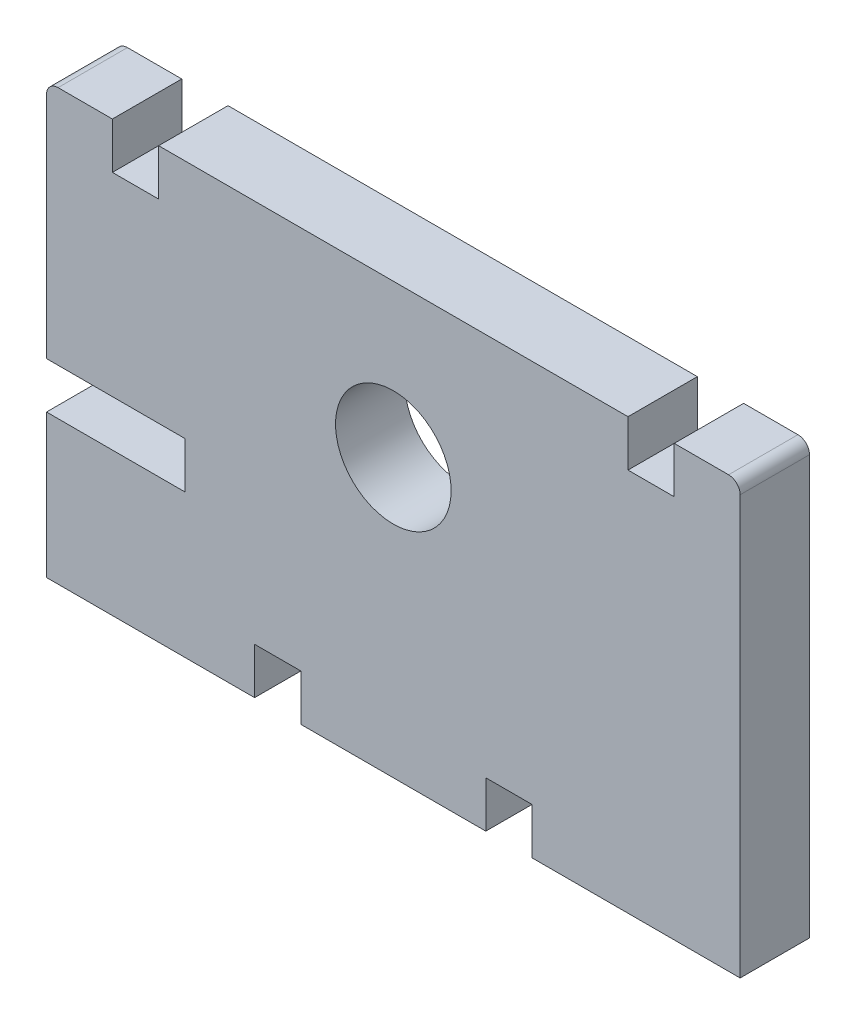
ISO-10303-21;
HEADER;
FILE_DESCRIPTION(('STEP AP214'),'2;1');
FILE_NAME('part.step','',(''),(''),'','','');
FILE_SCHEMA(('AUTOMOTIVE_DESIGN { 1 0 10303 214 1 1 1 1 }'));
ENDSEC;
DATA;
#1=APPLICATION_CONTEXT('core data for automotive mechanical design processes');
#2=APPLICATION_PROTOCOL_DEFINITION('international standard','automotive_design',2000,#1);
#3=PRODUCT_CONTEXT('',#1,'mechanical');
#4=PRODUCT('Part','Part','',(#3));
#5=PRODUCT_RELATED_PRODUCT_CATEGORY('part','',(#4));
#6=PRODUCT_DEFINITION_FORMATION('','',#4);
#7=PRODUCT_DEFINITION_CONTEXT('part definition',#1,'design');
#8=PRODUCT_DEFINITION('design','',#6,#7);
#9=PRODUCT_DEFINITION_SHAPE('','',#8);
#10=(LENGTH_UNIT() NAMED_UNIT(*) SI_UNIT(.MILLI.,.METRE.));
#11=(NAMED_UNIT(*) PLANE_ANGLE_UNIT() SI_UNIT($,.RADIAN.));
#12=(NAMED_UNIT(*) SI_UNIT($,.STERADIAN.) SOLID_ANGLE_UNIT());
#13=UNCERTAINTY_MEASURE_WITH_UNIT(LENGTH_MEASURE(1.E-05),#10,'distance_accuracy_value','');
#14=(GEOMETRIC_REPRESENTATION_CONTEXT(3) GLOBAL_UNCERTAINTY_ASSIGNED_CONTEXT((#13)) GLOBAL_UNIT_ASSIGNED_CONTEXT((#10,
#11,#12)) REPRESENTATION_CONTEXT('',''));
#15=CARTESIAN_POINT('',(0.,0.,0.));
#16=DIRECTION('',(0.,0.,1.));
#17=DIRECTION('',(1.,0.,0.));
#18=AXIS2_PLACEMENT_3D('',#15,#16,#17);
#19=CARTESIAN_POINT('',(3.99999999999999,0.,3.));
#20=DIRECTION('',(1.,0.,0.));
#21=DIRECTION('',(0.,1.,0.));
#22=AXIS2_PLACEMENT_3D('',#19,#20,#21);
#23=PLANE('',#22);
#24=DIRECTION('',(0.,-1.,0.));
#25=VECTOR('',#24,1.);
#26=CARTESIAN_POINT('',(3.99999999999999,0.,0.));
#27=LINE('',#26,#25);
#28=CARTESIAN_POINT('',(4.,-10.,0.));
#29=VERTEX_POINT('',#28);
#30=CARTESIAN_POINT('',(4.,-12.,0.));
#31=VERTEX_POINT('',#30);
#32=EDGE_CURVE('E219',#29,#31,#27,.T.);
#33=ORIENTED_EDGE('',*,*,#32,.F.);
#34=DIRECTION('',(0.,0.,-1.));
#35=VECTOR('',#34,1.);
#36=CARTESIAN_POINT('',(4.,-10.,3.));
#37=LINE('',#36,#35);
#38=CARTESIAN_POINT('',(4.,-10.,3.));
#39=VERTEX_POINT('',#38);
#40=EDGE_CURVE('E215',#39,#29,#37,.T.);
#41=ORIENTED_EDGE('',*,*,#40,.F.);
#42=DIRECTION('',(0.,-1.,0.));
#43=VECTOR('',#42,1.);
#44=CARTESIAN_POINT('',(3.99999999999999,0.,3.));
#45=LINE('',#44,#43);
#46=CARTESIAN_POINT('',(4.,-12.,3.));
#47=VERTEX_POINT('',#46);
#48=EDGE_CURVE('E217',#39,#47,#45,.T.);
#49=ORIENTED_EDGE('',*,*,#48,.T.);
#50=DIRECTION('',(0.,0.,-1.));
#51=VECTOR('',#50,1.);
#52=CARTESIAN_POINT('',(4.,-12.,3.));
#53=LINE('',#52,#51);
#54=EDGE_CURVE('E397',#47,#31,#53,.T.);
#55=ORIENTED_EDGE('',*,*,#54,.T.);
#56=EDGE_LOOP('',(#33,#41,#49,#55));
#57=FACE_BOUND('',#56,.T.);
#58=ADVANCED_FACE('F41',(#57),#23,.T.);
#59=CARTESIAN_POINT('',(0.,-10.,3.));
#60=DIRECTION('',(0.,-1.,0.));
#61=DIRECTION('',(0.,0.,-1.));
#62=AXIS2_PLACEMENT_3D('',#59,#60,#61);
#63=PLANE('',#62);
#64=DIRECTION('',(-1.,0.,0.));
#65=VECTOR('',#64,1.);
#66=CARTESIAN_POINT('',(0.,-10.,0.));
#67=LINE('',#66,#65);
#68=CARTESIAN_POINT('',(6.,-10.,0.));
#69=VERTEX_POINT('',#68);
#70=EDGE_CURVE('E320',#69,#29,#67,.T.);
#71=ORIENTED_EDGE('',*,*,#70,.F.);
#72=DIRECTION('',(0.,0.,-1.));
#73=VECTOR('',#72,1.);
#74=CARTESIAN_POINT('',(6.,-10.,3.));
#75=LINE('',#74,#73);
#76=CARTESIAN_POINT('',(6.,-10.,3.));
#77=VERTEX_POINT('',#76);
#78=EDGE_CURVE('E226',#77,#69,#75,.T.);
#79=ORIENTED_EDGE('',*,*,#78,.F.);
#80=DIRECTION('',(-1.,0.,0.));
#81=VECTOR('',#80,1.);
#82=CARTESIAN_POINT('',(0.,-10.,3.));
#83=LINE('',#82,#81);
#84=EDGE_CURVE('E232',#77,#39,#83,.T.);
#85=ORIENTED_EDGE('',*,*,#84,.T.);
#86=ORIENTED_EDGE('',*,*,#40,.T.);
#87=EDGE_LOOP('',(#71,#79,#85,#86));
#88=FACE_BOUND('',#87,.T.);
#89=ADVANCED_FACE('F240',(#88),#63,.T.);
#90=CARTESIAN_POINT('',(6.,0.,3.));
#91=DIRECTION('',(-1.,0.,0.));
#92=DIRECTION('',(0.,0.,1.));
#93=AXIS2_PLACEMENT_3D('',#90,#91,#92);
#94=PLANE('',#93);
#95=DIRECTION('',(0.,1.,0.));
#96=VECTOR('',#95,1.);
#97=CARTESIAN_POINT('',(6.,0.,0.));
#98=LINE('',#97,#96);
#99=CARTESIAN_POINT('',(6.,-12.,0.));
#100=VERTEX_POINT('',#99);
#101=EDGE_CURVE('E323',#100,#69,#98,.T.);
#102=ORIENTED_EDGE('',*,*,#101,.F.);
#103=DIRECTION('',(0.,0.,-1.));
#104=VECTOR('',#103,1.);
#105=CARTESIAN_POINT('',(6.,-12.,3.));
#106=LINE('',#105,#104);
#107=CARTESIAN_POINT('',(6.,-12.,3.));
#108=VERTEX_POINT('',#107);
#109=EDGE_CURVE('E464',#108,#100,#106,.T.);
#110=ORIENTED_EDGE('',*,*,#109,.F.);
#111=DIRECTION('',(0.,1.,0.));
#112=VECTOR('',#111,1.);
#113=CARTESIAN_POINT('',(6.,0.,3.));
#114=LINE('',#113,#112);
#115=EDGE_CURVE('E242',#108,#77,#114,.T.);
#116=ORIENTED_EDGE('',*,*,#115,.T.);
#117=ORIENTED_EDGE('',*,*,#78,.T.);
#118=EDGE_LOOP('',(#102,#110,#116,#117));
#119=FACE_BOUND('',#118,.T.);
#120=ADVANCED_FACE('F548',(#119),#94,.T.);
#121=CARTESIAN_POINT('',(0.,-12.,3.));
#122=DIRECTION('',(0.,1.,0.));
#123=DIRECTION('',(0.,0.,1.));
#124=AXIS2_PLACEMENT_3D('',#121,#122,#123);
#125=PLANE('',#124);
#126=DIRECTION('',(1.,0.,0.));
#127=VECTOR('',#126,1.);
#128=CARTESIAN_POINT('',(0.,-12.,0.));
#129=LINE('',#128,#127);
#130=CARTESIAN_POINT('',(15.,-12.,0.));
#131=VERTEX_POINT('',#130);
#132=EDGE_CURVE('E327',#100,#131,#129,.T.);
#133=ORIENTED_EDGE('',*,*,#132,.T.);
#134=DIRECTION('',(0.,0.,-1.));
#135=VECTOR('',#134,1.);
#136=CARTESIAN_POINT('',(15.,-12.,3.));
#137=LINE('',#136,#135);
#138=CARTESIAN_POINT('',(15.,-12.,3.));
#139=VERTEX_POINT('',#138);
#140=EDGE_CURVE('E460',#139,#131,#137,.T.);
#141=ORIENTED_EDGE('',*,*,#140,.F.);
#142=DIRECTION('',(1.,0.,0.));
#143=VECTOR('',#142,1.);
#144=CARTESIAN_POINT('',(0.,-12.,3.));
#145=LINE('',#144,#143);
#146=EDGE_CURVE('E245',#108,#139,#145,.T.);
#147=ORIENTED_EDGE('',*,*,#146,.F.);
#148=ORIENTED_EDGE('',*,*,#109,.T.);
#149=EDGE_LOOP('',(#133,#141,#147,#148));
#150=FACE_BOUND('',#149,.T.);
#151=ADVANCED_FACE('F612',(#150),#125,.F.);
#152=CARTESIAN_POINT('',(15.,0.,3.));
#153=DIRECTION('',(1.,0.,0.));
#154=DIRECTION('',(0.,1.,0.));
#155=AXIS2_PLACEMENT_3D('',#152,#153,#154);
#156=PLANE('',#155);
#157=DIRECTION('',(0.,-1.,0.));
#158=VECTOR('',#157,1.);
#159=CARTESIAN_POINT('',(15.,0.,0.));
#160=LINE('',#159,#158);
#161=CARTESIAN_POINT('',(15.,6.1,0.));
#162=VERTEX_POINT('',#161);
#163=EDGE_CURVE('E331',#162,#131,#160,.T.);
#164=ORIENTED_EDGE('',*,*,#163,.F.);
#165=DIRECTION('',(0.,0.,-1.));
#166=VECTOR('',#165,1.);
#167=CARTESIAN_POINT('',(15.,6.1,3.));
#168=LINE('',#167,#166);
#169=CARTESIAN_POINT('',(15.,6.1,3.));
#170=VERTEX_POINT('',#169);
#171=EDGE_CURVE('E11',#162,#170,#168,.F.);
#172=ORIENTED_EDGE('',*,*,#171,.T.);
#173=DIRECTION('',(0.,-1.,0.));
#174=VECTOR('',#173,1.);
#175=CARTESIAN_POINT('',(15.,0.,3.));
#176=LINE('',#175,#174);
#177=EDGE_CURVE('E252',#170,#139,#176,.T.);
#178=ORIENTED_EDGE('',*,*,#177,.T.);
#179=ORIENTED_EDGE('',*,*,#140,.T.);
#180=EDGE_LOOP('',(#164,#172,#178,#179));
#181=FACE_BOUND('',#180,.T.);
#182=ADVANCED_FACE('F613',(#181),#156,.T.);
#183=CARTESIAN_POINT('',(0.,6.6,3.));
#184=DIRECTION('',(0.,1.,0.));
#185=DIRECTION('',(0.,0.,1.));
#186=AXIS2_PLACEMENT_3D('',#183,#184,#185);
#187=PLANE('',#186);
#188=DIRECTION('',(1.,0.,0.));
#189=VECTOR('',#188,1.);
#190=CARTESIAN_POINT('',(0.,6.6,3.));
#191=LINE('',#190,#189);
#192=CARTESIAN_POINT('',(12.15,6.6,3.));
#193=VERTEX_POINT('',#192);
#194=CARTESIAN_POINT('',(14.5,6.6,3.));
#195=VERTEX_POINT('',#194);
#196=EDGE_CURVE('E256',#193,#195,#191,.T.);
#197=ORIENTED_EDGE('',*,*,#196,.T.);
#198=DIRECTION('',(0.,0.,-1.));
#199=VECTOR('',#198,1.);
#200=CARTESIAN_POINT('',(14.5,6.6,3.));
#201=LINE('',#200,#199);
#202=CARTESIAN_POINT('',(14.5,6.6,0.));
#203=VERTEX_POINT('',#202);
#204=EDGE_CURVE('E50',#195,#203,#201,.T.);
#205=ORIENTED_EDGE('',*,*,#204,.T.);
#206=DIRECTION('',(1.,0.,0.));
#207=VECTOR('',#206,1.);
#208=CARTESIAN_POINT('',(0.,6.6,0.));
#209=LINE('',#208,#207);
#210=CARTESIAN_POINT('',(12.15,6.6,0.));
#211=VERTEX_POINT('',#210);
#212=EDGE_CURVE('E336',#211,#203,#209,.T.);
#213=ORIENTED_EDGE('',*,*,#212,.F.);
#214=DIRECTION('',(0.,0.,-1.));
#215=VECTOR('',#214,1.);
#216=CARTESIAN_POINT('',(12.15,6.6,3.));
#217=LINE('',#216,#215);
#218=EDGE_CURVE('E457',#193,#211,#217,.T.);
#219=ORIENTED_EDGE('',*,*,#218,.F.);
#220=EDGE_LOOP('',(#197,#205,#213,#219));
#221=FACE_BOUND('',#220,.T.);
#222=ADVANCED_FACE('F490',(#221),#187,.T.);
#223=CARTESIAN_POINT('',(12.15,0.,3.));
#224=DIRECTION('',(1.,0.,0.));
#225=DIRECTION('',(0.,0.,-1.));
#226=AXIS2_PLACEMENT_3D('',#223,#224,#225);
#227=PLANE('',#226);
#228=DIRECTION('',(0.,-1.,0.));
#229=VECTOR('',#228,1.);
#230=CARTESIAN_POINT('',(12.15,0.,0.));
#231=LINE('',#230,#229);
#232=CARTESIAN_POINT('',(12.15,4.6,0.));
#233=VERTEX_POINT('',#232);
#234=EDGE_CURVE('E340',#211,#233,#231,.T.);
#235=ORIENTED_EDGE('',*,*,#234,.T.);
#236=DIRECTION('',(0.,0.,-1.));
#237=VECTOR('',#236,1.);
#238=CARTESIAN_POINT('',(12.15,4.6,3.));
#239=LINE('',#238,#237);
#240=CARTESIAN_POINT('',(12.15,4.6,3.));
#241=VERTEX_POINT('',#240);
#242=EDGE_CURVE('E453',#241,#233,#239,.T.);
#243=ORIENTED_EDGE('',*,*,#242,.F.);
#244=DIRECTION('',(0.,-1.,0.));
#245=VECTOR('',#244,1.);
#246=CARTESIAN_POINT('',(12.15,0.,3.));
#247=LINE('',#246,#245);
#248=EDGE_CURVE('E259',#193,#241,#247,.T.);
#249=ORIENTED_EDGE('',*,*,#248,.F.);
#250=ORIENTED_EDGE('',*,*,#218,.T.);
#251=EDGE_LOOP('',(#235,#243,#249,#250));
#252=FACE_BOUND('',#251,.T.);
#253=ADVANCED_FACE('F498',(#252),#227,.F.);
#254=CARTESIAN_POINT('',(0.,4.6,3.));
#255=DIRECTION('',(0.,-1.,0.));
#256=DIRECTION('',(1.,0.,0.));
#257=AXIS2_PLACEMENT_3D('',#254,#255,#256);
#258=PLANE('',#257);
#259=DIRECTION('',(-1.,0.,0.));
#260=VECTOR('',#259,1.);
#261=CARTESIAN_POINT('',(0.,4.6,0.));
#262=LINE('',#261,#260);
#263=CARTESIAN_POINT('',(10.15,4.6,0.));
#264=VERTEX_POINT('',#263);
#265=EDGE_CURVE('E346',#233,#264,#262,.T.);
#266=ORIENTED_EDGE('',*,*,#265,.T.);
#267=DIRECTION('',(0.,0.,-1.));
#268=VECTOR('',#267,1.);
#269=CARTESIAN_POINT('',(10.15,4.6,3.));
#270=LINE('',#269,#268);
#271=CARTESIAN_POINT('',(10.15,4.6,3.));
#272=VERTEX_POINT('',#271);
#273=EDGE_CURVE('E449',#272,#264,#270,.T.);
#274=ORIENTED_EDGE('',*,*,#273,.F.);
#275=DIRECTION('',(-1.,0.,0.));
#276=VECTOR('',#275,1.);
#277=CARTESIAN_POINT('',(0.,4.6,3.));
#278=LINE('',#277,#276);
#279=EDGE_CURVE('E265',#241,#272,#278,.T.);
#280=ORIENTED_EDGE('',*,*,#279,.F.);
#281=ORIENTED_EDGE('',*,*,#242,.T.);
#282=EDGE_LOOP('',(#266,#274,#280,#281));
#283=FACE_BOUND('',#282,.T.);
#284=ADVANCED_FACE('F504',(#283),#258,.F.);
#285=CARTESIAN_POINT('',(10.15,0.,3.));
#286=DIRECTION('',(-1.,0.,0.));
#287=DIRECTION('',(0.,-1.,0.));
#288=AXIS2_PLACEMENT_3D('',#285,#286,#287);
#289=PLANE('',#288);
#290=DIRECTION('',(0.,1.,0.));
#291=VECTOR('',#290,1.);
#292=CARTESIAN_POINT('',(10.15,0.,0.));
#293=LINE('',#292,#291);
#294=CARTESIAN_POINT('',(10.15,6.6,0.));
#295=VERTEX_POINT('',#294);
#296=EDGE_CURVE('E350',#264,#295,#293,.T.);
#297=ORIENTED_EDGE('',*,*,#296,.T.);
#298=DIRECTION('',(0.,0.,-1.));
#299=VECTOR('',#298,1.);
#300=CARTESIAN_POINT('',(10.15,6.6,3.));
#301=LINE('',#300,#299);
#302=CARTESIAN_POINT('',(10.15,6.6,3.));
#303=VERTEX_POINT('',#302);
#304=EDGE_CURVE('E446',#303,#295,#301,.T.);
#305=ORIENTED_EDGE('',*,*,#304,.F.);
#306=DIRECTION('',(0.,1.,0.));
#307=VECTOR('',#306,1.);
#308=CARTESIAN_POINT('',(10.15,0.,3.));
#309=LINE('',#308,#307);
#310=EDGE_CURVE('E269',#272,#303,#309,.T.);
#311=ORIENTED_EDGE('',*,*,#310,.F.);
#312=ORIENTED_EDGE('',*,*,#273,.T.);
#313=EDGE_LOOP('',(#297,#305,#311,#312));
#314=FACE_BOUND('',#313,.T.);
#315=ADVANCED_FACE('F506',(#314),#289,.F.);
#316=CARTESIAN_POINT('',(-10.15,6.6,0.));
#317=VERTEX_POINT('',#316);
#318=EDGE_CURVE('E342',#317,#295,#209,.T.);
#319=ORIENTED_EDGE('',*,*,#318,.F.);
#320=DIRECTION('',(0.,0.,-1.));
#321=VECTOR('',#320,1.);
#322=CARTESIAN_POINT('',(-10.15,6.6,3.));
#323=LINE('',#322,#321);
#324=CARTESIAN_POINT('',(-10.15,6.6,3.));
#325=VERTEX_POINT('',#324);
#326=EDGE_CURVE('E443',#325,#317,#323,.T.);
#327=ORIENTED_EDGE('',*,*,#326,.F.);
#328=EDGE_CURVE('E261',#325,#303,#191,.T.);
#329=ORIENTED_EDGE('',*,*,#328,.T.);
#330=ORIENTED_EDGE('',*,*,#304,.T.);
#331=EDGE_LOOP('',(#319,#327,#329,#330));
#332=FACE_BOUND('',#331,.T.);
#333=ADVANCED_FACE('F511',(#332),#187,.T.);
#334=CARTESIAN_POINT('',(-10.15,0.,3.));
#335=DIRECTION('',(-1.,0.,0.));
#336=DIRECTION('',(0.,-1.,0.));
#337=AXIS2_PLACEMENT_3D('',#334,#335,#336);
#338=PLANE('',#337);
#339=DIRECTION('',(0.,1.,0.));
#340=VECTOR('',#339,1.);
#341=CARTESIAN_POINT('',(-10.15,0.,0.));
#342=LINE('',#341,#340);
#343=CARTESIAN_POINT('',(-10.15,4.6,0.));
#344=VERTEX_POINT('',#343);
#345=EDGE_CURVE('E354',#344,#317,#342,.T.);
#346=ORIENTED_EDGE('',*,*,#345,.F.);
#347=DIRECTION('',(0.,0.,-1.));
#348=VECTOR('',#347,1.);
#349=CARTESIAN_POINT('',(-10.15,4.6,3.));
#350=LINE('',#349,#348);
#351=CARTESIAN_POINT('',(-10.15,4.6,3.));
#352=VERTEX_POINT('',#351);
#353=EDGE_CURVE('E440',#352,#344,#350,.T.);
#354=ORIENTED_EDGE('',*,*,#353,.F.);
#355=DIRECTION('',(0.,1.,0.));
#356=VECTOR('',#355,1.);
#357=CARTESIAN_POINT('',(-10.15,0.,3.));
#358=LINE('',#357,#356);
#359=EDGE_CURVE('E272',#352,#325,#358,.T.);
#360=ORIENTED_EDGE('',*,*,#359,.T.);
#361=ORIENTED_EDGE('',*,*,#326,.T.);
#362=EDGE_LOOP('',(#346,#354,#360,#361));
#363=FACE_BOUND('',#362,.T.);
#364=ADVANCED_FACE('F533',(#363),#338,.T.);
#365=CARTESIAN_POINT('',(0.,4.6,3.));
#366=DIRECTION('',(0.,1.,0.));
#367=DIRECTION('',(-1.,0.,0.));
#368=AXIS2_PLACEMENT_3D('',#365,#366,#367);
#369=PLANE('',#368);
#370=DIRECTION('',(1.,0.,0.));
#371=VECTOR('',#370,1.);
#372=CARTESIAN_POINT('',(0.,4.6,0.));
#373=LINE('',#372,#371);
#374=CARTESIAN_POINT('',(-12.15,4.6,0.));
#375=VERTEX_POINT('',#374);
#376=EDGE_CURVE('E358',#375,#344,#373,.T.);
#377=ORIENTED_EDGE('',*,*,#376,.F.);
#378=DIRECTION('',(0.,0.,-1.));
#379=VECTOR('',#378,1.);
#380=CARTESIAN_POINT('',(-12.15,4.6,3.));
#381=LINE('',#380,#379);
#382=CARTESIAN_POINT('',(-12.15,4.6,3.));
#383=VERTEX_POINT('',#382);
#384=EDGE_CURVE('E437',#383,#375,#381,.T.);
#385=ORIENTED_EDGE('',*,*,#384,.F.);
#386=DIRECTION('',(1.,0.,0.));
#387=VECTOR('',#386,1.);
#388=CARTESIAN_POINT('',(0.,4.6,3.));
#389=LINE('',#388,#387);
#390=EDGE_CURVE('E276',#383,#352,#389,.T.);
#391=ORIENTED_EDGE('',*,*,#390,.T.);
#392=ORIENTED_EDGE('',*,*,#353,.T.);
#393=EDGE_LOOP('',(#377,#385,#391,#392));
#394=FACE_BOUND('',#393,.T.);
#395=ADVANCED_FACE('F528',(#394),#369,.T.);
#396=CARTESIAN_POINT('',(-12.15,0.,3.));
#397=DIRECTION('',(1.,0.,0.));
#398=DIRECTION('',(0.,0.,-1.));
#399=AXIS2_PLACEMENT_3D('',#396,#397,#398);
#400=PLANE('',#399);
#401=DIRECTION('',(0.,-1.,0.));
#402=VECTOR('',#401,1.);
#403=CARTESIAN_POINT('',(-12.15,0.,0.));
#404=LINE('',#403,#402);
#405=CARTESIAN_POINT('',(-12.15,6.6,0.));
#406=VERTEX_POINT('',#405);
#407=EDGE_CURVE('E362',#406,#375,#404,.T.);
#408=ORIENTED_EDGE('',*,*,#407,.F.);
#409=DIRECTION('',(0.,0.,-1.));
#410=VECTOR('',#409,1.);
#411=CARTESIAN_POINT('',(-12.15,6.6,3.));
#412=LINE('',#411,#410);
#413=CARTESIAN_POINT('',(-12.15,6.6,3.));
#414=VERTEX_POINT('',#413);
#415=EDGE_CURVE('E433',#414,#406,#412,.T.);
#416=ORIENTED_EDGE('',*,*,#415,.F.);
#417=DIRECTION('',(0.,-1.,0.));
#418=VECTOR('',#417,1.);
#419=CARTESIAN_POINT('',(-12.15,0.,3.));
#420=LINE('',#419,#418);
#421=EDGE_CURVE('E280',#414,#383,#420,.T.);
#422=ORIENTED_EDGE('',*,*,#421,.T.);
#423=ORIENTED_EDGE('',*,*,#384,.T.);
#424=EDGE_LOOP('',(#408,#416,#422,#423));
#425=FACE_BOUND('',#424,.T.);
#426=ADVANCED_FACE('F524',(#425),#400,.T.);
#427=CARTESIAN_POINT('',(-14.5,6.6,0.));
#428=VERTEX_POINT('',#427);
#429=EDGE_CURVE('E341',#428,#406,#209,.T.);
#430=ORIENTED_EDGE('',*,*,#429,.F.);
#431=DIRECTION('',(0.,0.,-1.));
#432=VECTOR('',#431,1.);
#433=CARTESIAN_POINT('',(-14.5,6.6,3.));
#434=LINE('',#433,#432);
#435=CARTESIAN_POINT('',(-14.5,6.6,3.));
#436=VERTEX_POINT('',#435);
#437=EDGE_CURVE('E478',#428,#436,#434,.F.);
#438=ORIENTED_EDGE('',*,*,#437,.T.);
#439=EDGE_CURVE('E260',#436,#414,#191,.T.);
#440=ORIENTED_EDGE('',*,*,#439,.T.);
#441=ORIENTED_EDGE('',*,*,#415,.T.);
#442=EDGE_LOOP('',(#430,#438,#440,#441));
#443=FACE_BOUND('',#442,.T.);
#444=ADVANCED_FACE('F518',(#443),#187,.T.);
#445=CARTESIAN_POINT('',(-15.,0.,3.));
#446=DIRECTION('',(1.,0.,0.));
#447=DIRECTION('',(0.,1.,0.));
#448=AXIS2_PLACEMENT_3D('',#445,#446,#447);
#449=PLANE('',#448);
#450=DIRECTION('',(0.,-1.,0.));
#451=VECTOR('',#450,1.);
#452=CARTESIAN_POINT('',(-15.,0.,3.));
#453=LINE('',#452,#451);
#454=CARTESIAN_POINT('',(-15.,6.1,3.));
#455=VERTEX_POINT('',#454);
#456=CARTESIAN_POINT('',(-15.,-3.8,3.));
#457=VERTEX_POINT('',#456);
#458=EDGE_CURVE('E284',#455,#457,#453,.T.);
#459=ORIENTED_EDGE('',*,*,#458,.F.);
#460=DIRECTION('',(0.,0.,-1.));
#461=VECTOR('',#460,1.);
#462=CARTESIAN_POINT('',(-15.,6.1,0.));
#463=LINE('',#462,#461);
#464=CARTESIAN_POINT('',(-15.,6.1,0.));
#465=VERTEX_POINT('',#464);
#466=EDGE_CURVE('E225',#455,#465,#463,.T.);
#467=ORIENTED_EDGE('',*,*,#466,.T.);
#468=DIRECTION('',(0.,-1.,0.));
#469=VECTOR('',#468,1.);
#470=CARTESIAN_POINT('',(-15.,0.,0.));
#471=LINE('',#470,#469);
#472=CARTESIAN_POINT('',(-15.,-3.8,0.));
#473=VERTEX_POINT('',#472);
#474=EDGE_CURVE('E366',#465,#473,#471,.T.);
#475=ORIENTED_EDGE('',*,*,#474,.T.);
#476=DIRECTION('',(0.,0.,-1.));
#477=VECTOR('',#476,1.);
#478=CARTESIAN_POINT('',(-15.,-3.8,3.));
#479=LINE('',#478,#477);
#480=EDGE_CURVE('E429',#457,#473,#479,.T.);
#481=ORIENTED_EDGE('',*,*,#480,.F.);
#482=EDGE_LOOP('',(#459,#467,#475,#481));
#483=FACE_BOUND('',#482,.T.);
#484=ADVANCED_FACE('F571',(#483),#449,.F.);
#485=CARTESIAN_POINT('',(0.,-3.8,3.));
#486=DIRECTION('',(0.,-1.,0.));
#487=DIRECTION('',(0.,0.,-1.));
#488=AXIS2_PLACEMENT_3D('',#485,#486,#487);
#489=PLANE('',#488);
#490=DIRECTION('',(-1.,0.,0.));
#491=VECTOR('',#490,1.);
#492=CARTESIAN_POINT('',(0.,-3.8,0.));
#493=LINE('',#492,#491);
#494=CARTESIAN_POINT('',(-9.,-3.8,0.));
#495=VERTEX_POINT('',#494);
#496=EDGE_CURVE('E369',#495,#473,#493,.T.);
#497=ORIENTED_EDGE('',*,*,#496,.F.);
#498=DIRECTION('',(0.,0.,-1.));
#499=VECTOR('',#498,1.);
#500=CARTESIAN_POINT('',(-9.,-3.8,3.));
#501=LINE('',#500,#499);
#502=CARTESIAN_POINT('',(-9.,-3.8,3.));
#503=VERTEX_POINT('',#502);
#504=EDGE_CURVE('E426',#503,#495,#501,.T.);
#505=ORIENTED_EDGE('',*,*,#504,.F.);
#506=DIRECTION('',(-1.,0.,0.));
#507=VECTOR('',#506,1.);
#508=CARTESIAN_POINT('',(0.,-3.8,3.));
#509=LINE('',#508,#507);
#510=EDGE_CURVE('E287',#503,#457,#509,.T.);
#511=ORIENTED_EDGE('',*,*,#510,.T.);
#512=ORIENTED_EDGE('',*,*,#480,.T.);
#513=EDGE_LOOP('',(#497,#505,#511,#512));
#514=FACE_BOUND('',#513,.T.);
#515=ADVANCED_FACE('F574',(#514),#489,.T.);
#516=CARTESIAN_POINT('',(-9.,0.,3.));
#517=DIRECTION('',(-1.,0.,0.));
#518=DIRECTION('',(0.,0.,1.));
#519=AXIS2_PLACEMENT_3D('',#516,#517,#518);
#520=PLANE('',#519);
#521=DIRECTION('',(0.,1.,0.));
#522=VECTOR('',#521,1.);
#523=CARTESIAN_POINT('',(-9.,0.,0.));
#524=LINE('',#523,#522);
#525=CARTESIAN_POINT('',(-9.,-5.8,0.));
#526=VERTEX_POINT('',#525);
#527=EDGE_CURVE('E373',#526,#495,#524,.T.);
#528=ORIENTED_EDGE('',*,*,#527,.F.);
#529=DIRECTION('',(0.,0.,-1.));
#530=VECTOR('',#529,1.);
#531=CARTESIAN_POINT('',(-9.,-5.8,3.));
#532=LINE('',#531,#530);
#533=CARTESIAN_POINT('',(-9.,-5.8,3.));
#534=VERTEX_POINT('',#533);
#535=EDGE_CURVE('E423',#534,#526,#532,.T.);
#536=ORIENTED_EDGE('',*,*,#535,.F.);
#537=DIRECTION('',(0.,1.,0.));
#538=VECTOR('',#537,1.);
#539=CARTESIAN_POINT('',(-9.,0.,3.));
#540=LINE('',#539,#538);
#541=EDGE_CURVE('E291',#534,#503,#540,.T.);
#542=ORIENTED_EDGE('',*,*,#541,.T.);
#543=ORIENTED_EDGE('',*,*,#504,.T.);
#544=EDGE_LOOP('',(#528,#536,#542,#543));
#545=FACE_BOUND('',#544,.T.);
#546=ADVANCED_FACE('F579',(#545),#520,.T.);
#547=CARTESIAN_POINT('',(0.,-5.8,3.));
#548=DIRECTION('',(0.,1.,0.));
#549=DIRECTION('',(0.,0.,1.));
#550=AXIS2_PLACEMENT_3D('',#547,#548,#549);
#551=PLANE('',#550);
#552=DIRECTION('',(1.,0.,0.));
#553=VECTOR('',#552,1.);
#554=CARTESIAN_POINT('',(0.,-5.8,0.));
#555=LINE('',#554,#553);
#556=CARTESIAN_POINT('',(-15.,-5.8,0.));
#557=VERTEX_POINT('',#556);
#558=EDGE_CURVE('E377',#557,#526,#555,.T.);
#559=ORIENTED_EDGE('',*,*,#558,.F.);
#560=DIRECTION('',(0.,0.,-1.));
#561=VECTOR('',#560,1.);
#562=CARTESIAN_POINT('',(-15.,-5.8,3.));
#563=LINE('',#562,#561);
#564=CARTESIAN_POINT('',(-15.,-5.8,3.));
#565=VERTEX_POINT('',#564);
#566=EDGE_CURVE('E420',#565,#557,#563,.T.);
#567=ORIENTED_EDGE('',*,*,#566,.F.);
#568=DIRECTION('',(1.,0.,0.));
#569=VECTOR('',#568,1.);
#570=CARTESIAN_POINT('',(0.,-5.8,3.));
#571=LINE('',#570,#569);
#572=EDGE_CURVE('E295',#565,#534,#571,.T.);
#573=ORIENTED_EDGE('',*,*,#572,.T.);
#574=ORIENTED_EDGE('',*,*,#535,.T.);
#575=EDGE_LOOP('',(#559,#567,#573,#574));
#576=FACE_BOUND('',#575,.T.);
#577=ADVANCED_FACE('F582',(#576),#551,.T.);
#578=CARTESIAN_POINT('',(-15.,0.,3.));
#579=DIRECTION('',(1.,0.,0.));
#580=DIRECTION('',(0.,0.,-1.));
#581=AXIS2_PLACEMENT_3D('',#578,#579,#580);
#582=PLANE('',#581);
#583=DIRECTION('',(0.,-1.,0.));
#584=VECTOR('',#583,1.);
#585=CARTESIAN_POINT('',(-15.,0.,0.));
#586=LINE('',#585,#584);
#587=CARTESIAN_POINT('',(-15.,-12.,0.));
#588=VERTEX_POINT('',#587);
#589=EDGE_CURVE('E381',#557,#588,#586,.T.);
#590=ORIENTED_EDGE('',*,*,#589,.T.);
#591=DIRECTION('',(0.,0.,-1.));
#592=VECTOR('',#591,1.);
#593=CARTESIAN_POINT('',(-15.,-12.,3.));
#594=LINE('',#593,#592);
#595=CARTESIAN_POINT('',(-15.,-12.,3.));
#596=VERTEX_POINT('',#595);
#597=EDGE_CURVE('E416',#596,#588,#594,.T.);
#598=ORIENTED_EDGE('',*,*,#597,.F.);
#599=DIRECTION('',(0.,-1.,0.));
#600=VECTOR('',#599,1.);
#601=CARTESIAN_POINT('',(-15.,0.,3.));
#602=LINE('',#601,#600);
#603=EDGE_CURVE('E299',#565,#596,#602,.T.);
#604=ORIENTED_EDGE('',*,*,#603,.F.);
#605=ORIENTED_EDGE('',*,*,#566,.T.);
#606=EDGE_LOOP('',(#590,#598,#604,#605));
#607=FACE_BOUND('',#606,.T.);
#608=ADVANCED_FACE('F588',(#607),#582,.F.);
#609=CARTESIAN_POINT('',(-6.,-12.,0.));
#610=VERTEX_POINT('',#609);
#611=EDGE_CURVE('E333',#588,#610,#129,.T.);
#612=ORIENTED_EDGE('',*,*,#611,.T.);
#613=DIRECTION('',(0.,0.,-1.));
#614=VECTOR('',#613,1.);
#615=CARTESIAN_POINT('',(-6.,-12.,3.));
#616=LINE('',#615,#614);
#617=CARTESIAN_POINT('',(-6.,-12.,3.));
#618=VERTEX_POINT('',#617);
#619=EDGE_CURVE('E412',#618,#610,#616,.T.);
#620=ORIENTED_EDGE('',*,*,#619,.F.);
#621=EDGE_CURVE('E253',#596,#618,#145,.T.);
#622=ORIENTED_EDGE('',*,*,#621,.F.);
#623=ORIENTED_EDGE('',*,*,#597,.T.);
#624=EDGE_LOOP('',(#612,#620,#622,#623));
#625=FACE_BOUND('',#624,.T.);
#626=ADVANCED_FACE('F592',(#625),#125,.F.);
#627=CARTESIAN_POINT('',(-6.,0.,3.));
#628=DIRECTION('',(-1.,0.,0.));
#629=DIRECTION('',(0.,0.,1.));
#630=AXIS2_PLACEMENT_3D('',#627,#628,#629);
#631=PLANE('',#630);
#632=DIRECTION('',(0.,1.,0.));
#633=VECTOR('',#632,1.);
#634=CARTESIAN_POINT('',(-6.,0.,0.));
#635=LINE('',#634,#633);
#636=CARTESIAN_POINT('',(-6.,-10.,0.));
#637=VERTEX_POINT('',#636);
#638=EDGE_CURVE('E385',#610,#637,#635,.T.);
#639=ORIENTED_EDGE('',*,*,#638,.T.);
#640=DIRECTION('',(0.,0.,-1.));
#641=VECTOR('',#640,1.);
#642=CARTESIAN_POINT('',(-6.,-10.,3.));
#643=LINE('',#642,#641);
#644=CARTESIAN_POINT('',(-6.,-10.,3.));
#645=VERTEX_POINT('',#644);
#646=EDGE_CURVE('E408',#645,#637,#643,.T.);
#647=ORIENTED_EDGE('',*,*,#646,.F.);
#648=DIRECTION('',(0.,1.,0.));
#649=VECTOR('',#648,1.);
#650=CARTESIAN_POINT('',(-6.,0.,3.));
#651=LINE('',#650,#649);
#652=EDGE_CURVE('E303',#618,#645,#651,.T.);
#653=ORIENTED_EDGE('',*,*,#652,.F.);
#654=ORIENTED_EDGE('',*,*,#619,.T.);
#655=EDGE_LOOP('',(#639,#647,#653,#654));
#656=FACE_BOUND('',#655,.T.);
#657=ADVANCED_FACE('F596',(#656),#631,.F.);
#658=CARTESIAN_POINT('',(0.,-10.,3.));
#659=DIRECTION('',(0.,1.,0.));
#660=DIRECTION('',(0.,0.,1.));
#661=AXIS2_PLACEMENT_3D('',#658,#659,#660);
#662=PLANE('',#661);
#663=DIRECTION('',(1.,0.,0.));
#664=VECTOR('',#663,1.);
#665=CARTESIAN_POINT('',(0.,-10.,0.));
#666=LINE('',#665,#664);
#667=CARTESIAN_POINT('',(-4.,-10.,0.));
#668=VERTEX_POINT('',#667);
#669=EDGE_CURVE('E389',#637,#668,#666,.T.);
#670=ORIENTED_EDGE('',*,*,#669,.T.);
#671=DIRECTION('',(0.,0.,-1.));
#672=VECTOR('',#671,1.);
#673=CARTESIAN_POINT('',(-4.,-10.,3.));
#674=LINE('',#673,#672);
#675=CARTESIAN_POINT('',(-4.,-10.,3.));
#676=VERTEX_POINT('',#675);
#677=EDGE_CURVE('E404',#676,#668,#674,.T.);
#678=ORIENTED_EDGE('',*,*,#677,.F.);
#679=DIRECTION('',(1.,0.,0.));
#680=VECTOR('',#679,1.);
#681=CARTESIAN_POINT('',(0.,-10.,3.));
#682=LINE('',#681,#680);
#683=EDGE_CURVE('E307',#645,#676,#682,.T.);
#684=ORIENTED_EDGE('',*,*,#683,.F.);
#685=ORIENTED_EDGE('',*,*,#646,.T.);
#686=EDGE_LOOP('',(#670,#678,#684,#685));
#687=FACE_BOUND('',#686,.T.);
#688=ADVANCED_FACE('F601',(#687),#662,.F.);
#689=CARTESIAN_POINT('',(-3.99999999999999,0.,3.));
#690=DIRECTION('',(1.,0.,0.));
#691=DIRECTION('',(0.,1.,0.));
#692=AXIS2_PLACEMENT_3D('',#689,#690,#691);
#693=PLANE('',#692);
#694=DIRECTION('',(0.,-1.,0.));
#695=VECTOR('',#694,1.);
#696=CARTESIAN_POINT('',(-3.99999999999999,0.,0.));
#697=LINE('',#696,#695);
#698=CARTESIAN_POINT('',(-4.,-12.,0.));
#699=VERTEX_POINT('',#698);
#700=EDGE_CURVE('E393',#668,#699,#697,.T.);
#701=ORIENTED_EDGE('',*,*,#700,.T.);
#702=DIRECTION('',(0.,0.,-1.));
#703=VECTOR('',#702,1.);
#704=CARTESIAN_POINT('',(-4.,-12.,3.));
#705=LINE('',#704,#703);
#706=CARTESIAN_POINT('',(-4.,-12.,3.));
#707=VERTEX_POINT('',#706);
#708=EDGE_CURVE('E400',#707,#699,#705,.T.);
#709=ORIENTED_EDGE('',*,*,#708,.F.);
#710=DIRECTION('',(0.,-1.,0.));
#711=VECTOR('',#710,1.);
#712=CARTESIAN_POINT('',(-3.99999999999999,0.,3.));
#713=LINE('',#712,#711);
#714=EDGE_CURVE('E311',#676,#707,#713,.T.);
#715=ORIENTED_EDGE('',*,*,#714,.F.);
#716=ORIENTED_EDGE('',*,*,#677,.T.);
#717=EDGE_LOOP('',(#701,#709,#715,#716));
#718=FACE_BOUND('',#717,.T.);
#719=ADVANCED_FACE('F555',(#718),#693,.F.);
#720=CARTESIAN_POINT('',(0.,0.,3.));
#721=DIRECTION('',(0.,0.,-1.));
#722=DIRECTION('',(-1.,0.,0.));
#723=AXIS2_PLACEMENT_3D('',#720,#721,#722);
#724=CYLINDRICAL_SURFACE('',#723,2.5);
#725=CARTESIAN_POINT('',(0.,0.,3.));
#726=DIRECTION('',(0.,0.,1.));
#727=DIRECTION('',(1.,0.,0.));
#728=AXIS2_PLACEMENT_3D('',#725,#726,#727);
#729=CIRCLE('',#728,2.5);
#730=CARTESIAN_POINT('',(2.5,0.,3.));
#731=VERTEX_POINT('',#730);
#732=EDGE_CURVE('E238',#731,#731,#729,.T.);
#733=ORIENTED_EDGE('',*,*,#732,.T.);
#734=EDGE_LOOP('',(#733));
#735=FACE_BOUND('',#734,.T.);
#736=CARTESIAN_POINT('',(0.,0.,0.));
#737=DIRECTION('',(0.,0.,1.));
#738=DIRECTION('',(1.,0.,0.));
#739=AXIS2_PLACEMENT_3D('',#736,#737,#738);
#740=CIRCLE('',#739,2.5);
#741=CARTESIAN_POINT('',(2.5,0.,0.));
#742=VERTEX_POINT('',#741);
#743=EDGE_CURVE('E314',#742,#742,#740,.T.);
#744=ORIENTED_EDGE('',*,*,#743,.F.);
#745=EDGE_LOOP('',(#744));
#746=FACE_BOUND('',#745,.T.);
#747=ADVANCED_FACE('F552',(#735,#746),#724,.F.);
#748=EDGE_CURVE('E332',#699,#31,#129,.T.);
#749=ORIENTED_EDGE('',*,*,#748,.T.);
#750=ORIENTED_EDGE('',*,*,#54,.F.);
#751=EDGE_CURVE('E235',#707,#47,#145,.T.);
#752=ORIENTED_EDGE('',*,*,#751,.F.);
#753=ORIENTED_EDGE('',*,*,#708,.T.);
#754=EDGE_LOOP('',(#749,#750,#752,#753));
#755=FACE_BOUND('',#754,.T.);
#756=ADVANCED_FACE('F554',(#755),#125,.F.);
#757=CARTESIAN_POINT('',(0.,0.,3.));
#758=DIRECTION('',(0.,0.,1.));
#759=DIRECTION('',(1.,0.,0.));
#760=AXIS2_PLACEMENT_3D('',#757,#758,#759);
#761=PLANE('',#760);
#762=ORIENTED_EDGE('',*,*,#732,.F.);
#763=EDGE_LOOP('',(#762));
#764=FACE_BOUND('',#763,.T.);
#765=ORIENTED_EDGE('',*,*,#439,.F.);
#766=CARTESIAN_POINT('',(-14.5,6.1,3.));
#767=DIRECTION('',(0.,0.,1.));
#768=DIRECTION('',(1.,0.,0.));
#769=AXIS2_PLACEMENT_3D('',#766,#767,#768);
#770=CIRCLE('',#769,0.5);
#771=EDGE_CURVE('E483',#436,#455,#770,.T.);
#772=ORIENTED_EDGE('',*,*,#771,.T.);
#773=ORIENTED_EDGE('',*,*,#458,.T.);
#774=ORIENTED_EDGE('',*,*,#510,.F.);
#775=ORIENTED_EDGE('',*,*,#541,.F.);
#776=ORIENTED_EDGE('',*,*,#572,.F.);
#777=ORIENTED_EDGE('',*,*,#603,.T.);
#778=ORIENTED_EDGE('',*,*,#621,.T.);
#779=ORIENTED_EDGE('',*,*,#652,.T.);
#780=ORIENTED_EDGE('',*,*,#683,.T.);
#781=ORIENTED_EDGE('',*,*,#714,.T.);
#782=ORIENTED_EDGE('',*,*,#751,.T.);
#783=ORIENTED_EDGE('',*,*,#48,.F.);
#784=ORIENTED_EDGE('',*,*,#84,.F.);
#785=ORIENTED_EDGE('',*,*,#115,.F.);
#786=ORIENTED_EDGE('',*,*,#146,.T.);
#787=ORIENTED_EDGE('',*,*,#177,.F.);
#788=CARTESIAN_POINT('',(14.5,6.1,3.));
#789=DIRECTION('',(0.,0.,1.));
#790=DIRECTION('',(1.,0.,0.));
#791=AXIS2_PLACEMENT_3D('',#788,#789,#790);
#792=CIRCLE('',#791,0.5);
#793=EDGE_CURVE('E57',#170,#195,#792,.T.);
#794=ORIENTED_EDGE('',*,*,#793,.T.);
#795=ORIENTED_EDGE('',*,*,#196,.F.);
#796=ORIENTED_EDGE('',*,*,#248,.T.);
#797=ORIENTED_EDGE('',*,*,#279,.T.);
#798=ORIENTED_EDGE('',*,*,#310,.T.);
#799=ORIENTED_EDGE('',*,*,#328,.F.);
#800=ORIENTED_EDGE('',*,*,#359,.F.);
#801=ORIENTED_EDGE('',*,*,#390,.F.);
#802=ORIENTED_EDGE('',*,*,#421,.F.);
#803=EDGE_LOOP('',(#765,#772,#773,#774,#775,#776,#777,#778,#779,#780,#781,#782,#783,#784,#785,
#786,#787,#794,#795,#796,#797,#798,#799,#800,#801,#802));
#804=FACE_BOUND('',#803,.T.);
#805=ADVANCED_FACE('F230',(#764,#804),#761,.T.);
#806=CARTESIAN_POINT('',(0.,0.,0.));
#807=DIRECTION('',(0.,0.,1.));
#808=DIRECTION('',(1.,0.,0.));
#809=AXIS2_PLACEMENT_3D('',#806,#807,#808);
#810=PLANE('',#809);
#811=ORIENTED_EDGE('',*,*,#743,.T.);
#812=EDGE_LOOP('',(#811));
#813=FACE_BOUND('',#812,.T.);
#814=ORIENTED_EDGE('',*,*,#474,.F.);
#815=CARTESIAN_POINT('',(-14.5,6.1,0.));
#816=DIRECTION('',(0.,0.,1.));
#817=DIRECTION('',(1.,0.,0.));
#818=AXIS2_PLACEMENT_3D('',#815,#816,#817);
#819=CIRCLE('',#818,0.5);
#820=EDGE_CURVE('E475',#465,#428,#819,.F.);
#821=ORIENTED_EDGE('',*,*,#820,.T.);
#822=ORIENTED_EDGE('',*,*,#429,.T.);
#823=ORIENTED_EDGE('',*,*,#407,.T.);
#824=ORIENTED_EDGE('',*,*,#376,.T.);
#825=ORIENTED_EDGE('',*,*,#345,.T.);
#826=ORIENTED_EDGE('',*,*,#318,.T.);
#827=ORIENTED_EDGE('',*,*,#296,.F.);
#828=ORIENTED_EDGE('',*,*,#265,.F.);
#829=ORIENTED_EDGE('',*,*,#234,.F.);
#830=ORIENTED_EDGE('',*,*,#212,.T.);
#831=CARTESIAN_POINT('',(14.5,6.1,0.));
#832=DIRECTION('',(0.,0.,1.));
#833=DIRECTION('',(1.,0.,0.));
#834=AXIS2_PLACEMENT_3D('',#831,#832,#833);
#835=CIRCLE('',#834,0.5);
#836=EDGE_CURVE('E472',#203,#162,#835,.F.);
#837=ORIENTED_EDGE('',*,*,#836,.T.);
#838=ORIENTED_EDGE('',*,*,#163,.T.);
#839=ORIENTED_EDGE('',*,*,#132,.F.);
#840=ORIENTED_EDGE('',*,*,#101,.T.);
#841=ORIENTED_EDGE('',*,*,#70,.T.);
#842=ORIENTED_EDGE('',*,*,#32,.T.);
#843=ORIENTED_EDGE('',*,*,#748,.F.);
#844=ORIENTED_EDGE('',*,*,#700,.F.);
#845=ORIENTED_EDGE('',*,*,#669,.F.);
#846=ORIENTED_EDGE('',*,*,#638,.F.);
#847=ORIENTED_EDGE('',*,*,#611,.F.);
#848=ORIENTED_EDGE('',*,*,#589,.F.);
#849=ORIENTED_EDGE('',*,*,#558,.T.);
#850=ORIENTED_EDGE('',*,*,#527,.T.);
#851=ORIENTED_EDGE('',*,*,#496,.T.);
#852=EDGE_LOOP('',(#814,#821,#822,#823,#824,#825,#826,#827,#828,#829,#830,#837,#838,#839,#840,
#841,#842,#843,#844,#845,#846,#847,#848,#849,#850,#851));
#853=FACE_BOUND('',#852,.T.);
#854=ADVANCED_FACE('F495',(#813,#853),#810,.F.);
#855=CARTESIAN_POINT('',(-14.5,6.1,3.));
#856=DIRECTION('',(0.,0.,1.));
#857=DIRECTION('',(1.,0.,0.));
#858=AXIS2_PLACEMENT_3D('',#855,#856,#857);
#859=CYLINDRICAL_SURFACE('',#858,0.5);
#860=ORIENTED_EDGE('',*,*,#771,.F.);
#861=ORIENTED_EDGE('',*,*,#437,.F.);
#862=ORIENTED_EDGE('',*,*,#820,.F.);
#863=ORIENTED_EDGE('',*,*,#466,.F.);
#864=EDGE_LOOP('',(#860,#861,#862,#863));
#865=FACE_BOUND('',#864,.T.);
#866=ADVANCED_FACE('F557',(#865),#859,.T.);
#867=CARTESIAN_POINT('',(14.5,6.1,3.));
#868=DIRECTION('',(0.,0.,-1.));
#869=DIRECTION('',(-1.,0.,0.));
#870=AXIS2_PLACEMENT_3D('',#867,#868,#869);
#871=CYLINDRICAL_SURFACE('',#870,0.5);
#872=ORIENTED_EDGE('',*,*,#793,.F.);
#873=ORIENTED_EDGE('',*,*,#171,.F.);
#874=ORIENTED_EDGE('',*,*,#836,.F.);
#875=ORIENTED_EDGE('',*,*,#204,.F.);
#876=EDGE_LOOP('',(#872,#873,#874,#875));
#877=FACE_BOUND('',#876,.T.);
#878=ADVANCED_FACE('F43',(#877),#871,.T.);
#879=CLOSED_SHELL('',(#58,#89,#120,#151,#182,#222,#253,#284,#315,#333,#364,#395,#426,#444,#484,
#515,#546,#577,#608,#626,#657,#688,#719,#747,#756,#805,#854,#866,#878));
#880=MANIFOLD_SOLID_BREP('B2',#879);
#881=ADVANCED_BREP_SHAPE_REPRESENTATION('',(#18,#880),#14);
#882=SHAPE_DEFINITION_REPRESENTATION(#9,#881);
ENDSEC;
END-ISO-10303-21;
